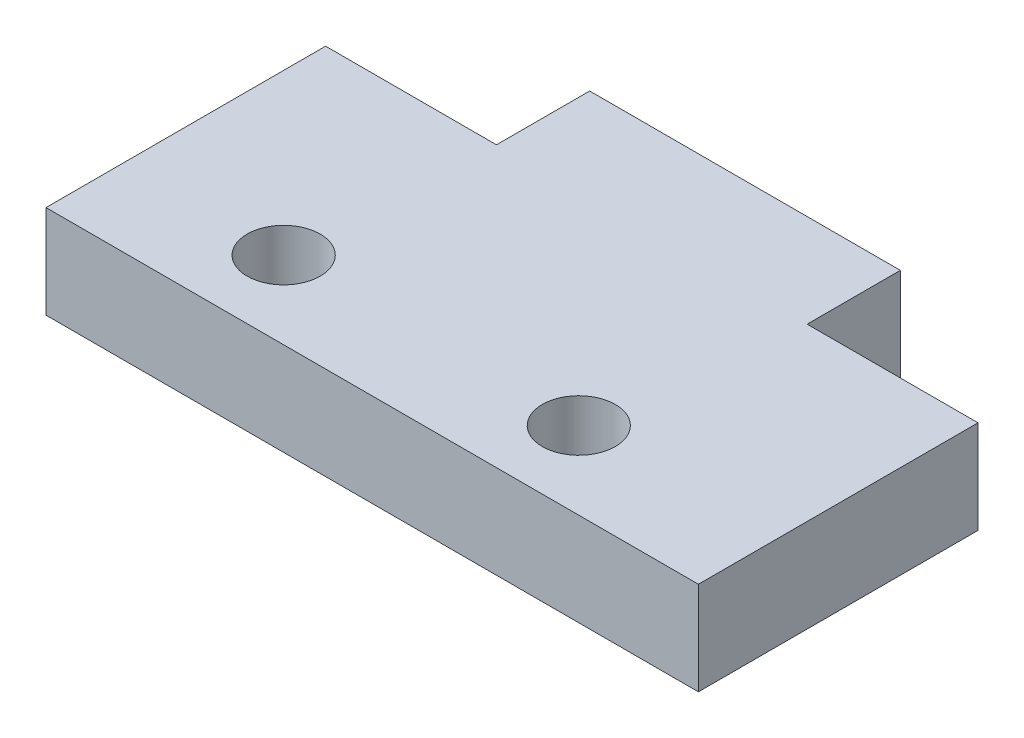
ISO-10303-21;
HEADER;
FILE_DESCRIPTION(('STEP AP214'),'2;1');
FILE_NAME('part.step','',(''),(''),'','','');
FILE_SCHEMA(('AUTOMOTIVE_DESIGN { 1 0 10303 214 1 1 1 1 }'));
ENDSEC;
DATA;
#1=APPLICATION_CONTEXT('core data for automotive mechanical design processes');
#2=APPLICATION_PROTOCOL_DEFINITION('international standard','automotive_design',2000,#1);
#3=PRODUCT_CONTEXT('',#1,'mechanical');
#4=PRODUCT('Part','Part','',(#3));
#5=PRODUCT_RELATED_PRODUCT_CATEGORY('part','',(#4));
#6=PRODUCT_DEFINITION_FORMATION('','',#4);
#7=PRODUCT_DEFINITION_CONTEXT('part definition',#1,'design');
#8=PRODUCT_DEFINITION('design','',#6,#7);
#9=PRODUCT_DEFINITION_SHAPE('','',#8);
#10=(LENGTH_UNIT() NAMED_UNIT(*) SI_UNIT(.MILLI.,.METRE.));
#11=(NAMED_UNIT(*) PLANE_ANGLE_UNIT() SI_UNIT($,.RADIAN.));
#12=(NAMED_UNIT(*) SI_UNIT($,.STERADIAN.) SOLID_ANGLE_UNIT());
#13=UNCERTAINTY_MEASURE_WITH_UNIT(LENGTH_MEASURE(1.E-05),#10,'distance_accuracy_value','');
#14=(GEOMETRIC_REPRESENTATION_CONTEXT(3) GLOBAL_UNCERTAINTY_ASSIGNED_CONTEXT((#13)) GLOBAL_UNIT_ASSIGNED_CONTEXT((#10,
#11,#12)) REPRESENTATION_CONTEXT('',''));
#15=CARTESIAN_POINT('',(0.,0.,0.));
#16=DIRECTION('',(0.,0.,1.));
#17=DIRECTION('',(1.,0.,0.));
#18=AXIS2_PLACEMENT_3D('',#15,#16,#17);
#19=CARTESIAN_POINT('',(0.,3.,0.));
#20=DIRECTION('',(0.,-1.,0.));
#21=DIRECTION('',(0.,0.,-1.));
#22=AXIS2_PLACEMENT_3D('',#19,#20,#21);
#23=PLANE('',#22);
#24=DIRECTION('',(0.,0.,1.));
#25=VECTOR('',#24,1.);
#26=CARTESIAN_POINT('',(0.,3.,3.));
#27=LINE('',#26,#25);
#28=CARTESIAN_POINT('',(0.,3.,0.));
#29=VERTEX_POINT('',#28);
#30=CARTESIAN_POINT('',(0.,3.,3.));
#31=VERTEX_POINT('',#30);
#32=EDGE_CURVE('E164',#29,#31,#27,.T.);
#33=ORIENTED_EDGE('',*,*,#32,.T.);
#34=DIRECTION('',(-1.,0.,0.));
#35=VECTOR('',#34,1.);
#36=CARTESIAN_POINT('',(-5.5,3.,3.));
#37=LINE('',#36,#35);
#38=CARTESIAN_POINT('',(-5.5,3.,3.));
#39=VERTEX_POINT('',#38);
#40=EDGE_CURVE('E100',#31,#39,#37,.T.);
#41=ORIENTED_EDGE('',*,*,#40,.T.);
#42=DIRECTION('',(0.,0.,1.));
#43=VECTOR('',#42,1.);
#44=CARTESIAN_POINT('',(-5.5,3.,12.));
#45=LINE('',#44,#43);
#46=CARTESIAN_POINT('',(-5.5,3.,12.));
#47=VERTEX_POINT('',#46);
#48=EDGE_CURVE('E185',#39,#47,#45,.T.);
#49=ORIENTED_EDGE('',*,*,#48,.T.);
#50=DIRECTION('',(1.,0.,0.));
#51=VECTOR('',#50,1.);
#52=CARTESIAN_POINT('',(15.5,3.,12.));
#53=LINE('',#52,#51);
#54=CARTESIAN_POINT('',(15.5,3.,12.));
#55=VERTEX_POINT('',#54);
#56=EDGE_CURVE('E199',#47,#55,#53,.T.);
#57=ORIENTED_EDGE('',*,*,#56,.T.);
#58=DIRECTION('',(0.,0.,-1.));
#59=VECTOR('',#58,1.);
#60=CARTESIAN_POINT('',(15.5,3.,3.));
#61=LINE('',#60,#59);
#62=CARTESIAN_POINT('',(15.5,3.,3.));
#63=VERTEX_POINT('',#62);
#64=EDGE_CURVE('E119',#55,#63,#61,.T.);
#65=ORIENTED_EDGE('',*,*,#64,.T.);
#66=DIRECTION('',(-1.,0.,0.));
#67=VECTOR('',#66,1.);
#68=CARTESIAN_POINT('',(10.,3.,3.));
#69=LINE('',#68,#67);
#70=CARTESIAN_POINT('',(10.,3.,3.));
#71=VERTEX_POINT('',#70);
#72=EDGE_CURVE('E113',#63,#71,#69,.T.);
#73=ORIENTED_EDGE('',*,*,#72,.T.);
#74=DIRECTION('',(0.,0.,-1.));
#75=VECTOR('',#74,1.);
#76=CARTESIAN_POINT('',(10.,3.,0.));
#77=LINE('',#76,#75);
#78=CARTESIAN_POINT('',(10.,3.,0.));
#79=VERTEX_POINT('',#78);
#80=EDGE_CURVE('E117',#71,#79,#77,.T.);
#81=ORIENTED_EDGE('',*,*,#80,.T.);
#82=DIRECTION('',(-1.,0.,0.));
#83=VECTOR('',#82,1.);
#84=CARTESIAN_POINT('',(0.,3.,0.));
#85=LINE('',#84,#83);
#86=EDGE_CURVE('E57',#79,#29,#85,.T.);
#87=ORIENTED_EDGE('',*,*,#86,.T.);
#88=EDGE_LOOP('',(#33,#41,#49,#57,#65,#73,#81,#87));
#89=FACE_BOUND('',#88,.T.);
#90=CARTESIAN_POINT('',(-0.35,3.,9.5));
#91=DIRECTION('',(0.,1.,0.));
#92=DIRECTION('',(0.,0.,1.));
#93=AXIS2_PLACEMENT_3D('',#90,#91,#92);
#94=CIRCLE('',#93,1.175);
#95=CARTESIAN_POINT('',(-0.35,3.,10.675));
#96=VERTEX_POINT('',#95);
#97=EDGE_CURVE('E146',#96,#96,#94,.T.);
#98=ORIENTED_EDGE('',*,*,#97,.F.);
#99=EDGE_LOOP('',(#98));
#100=FACE_BOUND('',#99,.T.);
#101=CARTESIAN_POINT('',(9.15,3.,9.5));
#102=DIRECTION('',(0.,1.,0.));
#103=DIRECTION('',(0.,0.,1.));
#104=AXIS2_PLACEMENT_3D('',#101,#102,#103);
#105=CIRCLE('',#104,1.175);
#106=CARTESIAN_POINT('',(9.15,3.,10.675));
#107=VERTEX_POINT('',#106);
#108=EDGE_CURVE('E213',#107,#107,#105,.T.);
#109=ORIENTED_EDGE('',*,*,#108,.F.);
#110=EDGE_LOOP('',(#109));
#111=FACE_BOUND('',#110,.T.);
#112=ADVANCED_FACE('F39',(#89,#100,#111),#23,.F.);
#113=CARTESIAN_POINT('',(0.,0.,0.));
#114=DIRECTION('',(0.,-1.,0.));
#115=DIRECTION('',(0.,0.,-1.));
#116=AXIS2_PLACEMENT_3D('',#113,#114,#115);
#117=PLANE('',#116);
#118=CARTESIAN_POINT('',(-0.35,0.,9.5));
#119=DIRECTION('',(0.,1.,0.));
#120=DIRECTION('',(0.,0.,1.));
#121=AXIS2_PLACEMENT_3D('',#118,#119,#120);
#122=CIRCLE('',#121,1.175);
#123=CARTESIAN_POINT('',(-0.35,0.,10.675));
#124=VERTEX_POINT('',#123);
#125=EDGE_CURVE('E209',#124,#124,#122,.T.);
#126=ORIENTED_EDGE('',*,*,#125,.T.);
#127=EDGE_LOOP('',(#126));
#128=FACE_BOUND('',#127,.T.);
#129=DIRECTION('',(0.,0.,1.));
#130=VECTOR('',#129,1.);
#131=CARTESIAN_POINT('',(0.,0.,3.));
#132=LINE('',#131,#130);
#133=CARTESIAN_POINT('',(0.,0.,0.));
#134=VERTEX_POINT('',#133);
#135=CARTESIAN_POINT('',(0.,0.,3.));
#136=VERTEX_POINT('',#135);
#137=EDGE_CURVE('E141',#134,#136,#132,.T.);
#138=ORIENTED_EDGE('',*,*,#137,.F.);
#139=DIRECTION('',(-1.,0.,0.));
#140=VECTOR('',#139,1.);
#141=CARTESIAN_POINT('',(0.,0.,0.));
#142=LINE('',#141,#140);
#143=CARTESIAN_POINT('',(10.,0.,0.));
#144=VERTEX_POINT('',#143);
#145=EDGE_CURVE('E92',#144,#134,#142,.T.);
#146=ORIENTED_EDGE('',*,*,#145,.F.);
#147=DIRECTION('',(0.,0.,-1.));
#148=VECTOR('',#147,1.);
#149=CARTESIAN_POINT('',(10.,0.,0.));
#150=LINE('',#149,#148);
#151=CARTESIAN_POINT('',(10.,0.,3.));
#152=VERTEX_POINT('',#151);
#153=EDGE_CURVE('E86',#152,#144,#150,.T.);
#154=ORIENTED_EDGE('',*,*,#153,.F.);
#155=DIRECTION('',(-1.,0.,0.));
#156=VECTOR('',#155,1.);
#157=CARTESIAN_POINT('',(10.,0.,3.));
#158=LINE('',#157,#156);
#159=CARTESIAN_POINT('',(15.5,0.,3.));
#160=VERTEX_POINT('',#159);
#161=EDGE_CURVE('E128',#160,#152,#158,.T.);
#162=ORIENTED_EDGE('',*,*,#161,.F.);
#163=DIRECTION('',(0.,0.,-1.));
#164=VECTOR('',#163,1.);
#165=CARTESIAN_POINT('',(15.5,0.,3.));
#166=LINE('',#165,#164);
#167=CARTESIAN_POINT('',(15.5,0.,12.));
#168=VERTEX_POINT('',#167);
#169=EDGE_CURVE('E155',#168,#160,#166,.T.);
#170=ORIENTED_EDGE('',*,*,#169,.F.);
#171=DIRECTION('',(1.,0.,0.));
#172=VECTOR('',#171,1.);
#173=CARTESIAN_POINT('',(15.5,0.,12.));
#174=LINE('',#173,#172);
#175=CARTESIAN_POINT('',(-5.5,0.,12.));
#176=VERTEX_POINT('',#175);
#177=EDGE_CURVE('E152',#176,#168,#174,.T.);
#178=ORIENTED_EDGE('',*,*,#177,.F.);
#179=DIRECTION('',(0.,0.,1.));
#180=VECTOR('',#179,1.);
#181=CARTESIAN_POINT('',(-5.5,0.,12.));
#182=LINE('',#181,#180);
#183=CARTESIAN_POINT('',(-5.5,0.,3.));
#184=VERTEX_POINT('',#183);
#185=EDGE_CURVE('E149',#184,#176,#182,.T.);
#186=ORIENTED_EDGE('',*,*,#185,.F.);
#187=DIRECTION('',(-1.,0.,0.));
#188=VECTOR('',#187,1.);
#189=CARTESIAN_POINT('',(-5.5,0.,3.));
#190=LINE('',#189,#188);
#191=EDGE_CURVE('E145',#136,#184,#190,.T.);
#192=ORIENTED_EDGE('',*,*,#191,.F.);
#193=EDGE_LOOP('',(#138,#146,#154,#162,#170,#178,#186,#192));
#194=FACE_BOUND('',#193,.T.);
#195=CARTESIAN_POINT('',(9.15,0.,9.5));
#196=DIRECTION('',(0.,1.,0.));
#197=DIRECTION('',(0.,0.,1.));
#198=AXIS2_PLACEMENT_3D('',#195,#196,#197);
#199=CIRCLE('',#198,1.175);
#200=CARTESIAN_POINT('',(9.15,0.,10.675));
#201=VERTEX_POINT('',#200);
#202=EDGE_CURVE('E217',#201,#201,#199,.T.);
#203=ORIENTED_EDGE('',*,*,#202,.T.);
#204=EDGE_LOOP('',(#203));
#205=FACE_BOUND('',#204,.T.);
#206=ADVANCED_FACE('F189',(#128,#194,#205),#117,.T.);
#207=CARTESIAN_POINT('',(0.,3.,3.));
#208=DIRECTION('',(1.,0.,0.));
#209=DIRECTION('',(0.,0.,-1.));
#210=AXIS2_PLACEMENT_3D('',#207,#208,#209);
#211=PLANE('',#210);
#212=ORIENTED_EDGE('',*,*,#137,.T.);
#213=DIRECTION('',(0.,-1.,0.));
#214=VECTOR('',#213,1.);
#215=CARTESIAN_POINT('',(0.,3.,3.));
#216=LINE('',#215,#214);
#217=EDGE_CURVE('E11',#31,#136,#216,.T.);
#218=ORIENTED_EDGE('',*,*,#217,.F.);
#219=ORIENTED_EDGE('',*,*,#32,.F.);
#220=DIRECTION('',(0.,-1.,0.));
#221=VECTOR('',#220,1.);
#222=CARTESIAN_POINT('',(0.,3.,0.));
#223=LINE('',#222,#221);
#224=EDGE_CURVE('E137',#29,#134,#223,.T.);
#225=ORIENTED_EDGE('',*,*,#224,.T.);
#226=EDGE_LOOP('',(#212,#218,#219,#225));
#227=FACE_BOUND('',#226,.T.);
#228=ADVANCED_FACE('F41',(#227),#211,.F.);
#229=CARTESIAN_POINT('',(-5.5,3.,3.));
#230=DIRECTION('',(0.,0.,1.));
#231=DIRECTION('',(1.,0.,0.));
#232=AXIS2_PLACEMENT_3D('',#229,#230,#231);
#233=PLANE('',#232);
#234=ORIENTED_EDGE('',*,*,#191,.T.);
#235=DIRECTION('',(0.,-1.,0.));
#236=VECTOR('',#235,1.);
#237=CARTESIAN_POINT('',(-5.5,3.,3.));
#238=LINE('',#237,#236);
#239=EDGE_CURVE('E49',#39,#184,#238,.T.);
#240=ORIENTED_EDGE('',*,*,#239,.F.);
#241=ORIENTED_EDGE('',*,*,#40,.F.);
#242=ORIENTED_EDGE('',*,*,#217,.T.);
#243=EDGE_LOOP('',(#234,#240,#241,#242));
#244=FACE_BOUND('',#243,.T.);
#245=ADVANCED_FACE('F251',(#244),#233,.F.);
#246=CARTESIAN_POINT('',(-5.5,3.,12.));
#247=DIRECTION('',(1.,0.,0.));
#248=DIRECTION('',(0.,0.,-1.));
#249=AXIS2_PLACEMENT_3D('',#246,#247,#248);
#250=PLANE('',#249);
#251=ORIENTED_EDGE('',*,*,#185,.T.);
#252=DIRECTION('',(0.,-1.,0.));
#253=VECTOR('',#252,1.);
#254=CARTESIAN_POINT('',(-5.5,3.,12.));
#255=LINE('',#254,#253);
#256=EDGE_CURVE('E175',#47,#176,#255,.T.);
#257=ORIENTED_EDGE('',*,*,#256,.F.);
#258=ORIENTED_EDGE('',*,*,#48,.F.);
#259=ORIENTED_EDGE('',*,*,#239,.T.);
#260=EDGE_LOOP('',(#251,#257,#258,#259));
#261=FACE_BOUND('',#260,.T.);
#262=ADVANCED_FACE('F183',(#261),#250,.F.);
#263=CARTESIAN_POINT('',(15.5,3.,12.));
#264=DIRECTION('',(0.,0.,-1.));
#265=DIRECTION('',(-1.,0.,0.));
#266=AXIS2_PLACEMENT_3D('',#263,#264,#265);
#267=PLANE('',#266);
#268=ORIENTED_EDGE('',*,*,#177,.T.);
#269=DIRECTION('',(0.,-1.,0.));
#270=VECTOR('',#269,1.);
#271=CARTESIAN_POINT('',(15.5,3.,12.));
#272=LINE('',#271,#270);
#273=EDGE_CURVE('E171',#55,#168,#272,.T.);
#274=ORIENTED_EDGE('',*,*,#273,.F.);
#275=ORIENTED_EDGE('',*,*,#56,.F.);
#276=ORIENTED_EDGE('',*,*,#256,.T.);
#277=EDGE_LOOP('',(#268,#274,#275,#276));
#278=FACE_BOUND('',#277,.T.);
#279=ADVANCED_FACE('F194',(#278),#267,.F.);
#280=CARTESIAN_POINT('',(15.5,3.,3.));
#281=DIRECTION('',(-1.,0.,0.));
#282=DIRECTION('',(0.,0.,1.));
#283=AXIS2_PLACEMENT_3D('',#280,#281,#282);
#284=PLANE('',#283);
#285=ORIENTED_EDGE('',*,*,#169,.T.);
#286=DIRECTION('',(0.,-1.,0.));
#287=VECTOR('',#286,1.);
#288=CARTESIAN_POINT('',(15.5,3.,3.));
#289=LINE('',#288,#287);
#290=EDGE_CURVE('E130',#63,#160,#289,.T.);
#291=ORIENTED_EDGE('',*,*,#290,.F.);
#292=ORIENTED_EDGE('',*,*,#64,.F.);
#293=ORIENTED_EDGE('',*,*,#273,.T.);
#294=EDGE_LOOP('',(#285,#291,#292,#293));
#295=FACE_BOUND('',#294,.T.);
#296=ADVANCED_FACE('F197',(#295),#284,.F.);
#297=CARTESIAN_POINT('',(10.,3.,3.));
#298=DIRECTION('',(0.,0.,1.));
#299=DIRECTION('',(1.,0.,0.));
#300=AXIS2_PLACEMENT_3D('',#297,#298,#299);
#301=PLANE('',#300);
#302=ORIENTED_EDGE('',*,*,#161,.T.);
#303=DIRECTION('',(0.,-1.,0.));
#304=VECTOR('',#303,1.);
#305=CARTESIAN_POINT('',(10.,3.,3.));
#306=LINE('',#305,#304);
#307=EDGE_CURVE('E125',#71,#152,#306,.T.);
#308=ORIENTED_EDGE('',*,*,#307,.F.);
#309=ORIENTED_EDGE('',*,*,#72,.F.);
#310=ORIENTED_EDGE('',*,*,#290,.T.);
#311=EDGE_LOOP('',(#302,#308,#309,#310));
#312=FACE_BOUND('',#311,.T.);
#313=ADVANCED_FACE('F126',(#312),#301,.F.);
#314=CARTESIAN_POINT('',(10.,3.,0.));
#315=DIRECTION('',(-1.,0.,0.));
#316=DIRECTION('',(0.,0.,1.));
#317=AXIS2_PLACEMENT_3D('',#314,#315,#316);
#318=PLANE('',#317);
#319=ORIENTED_EDGE('',*,*,#153,.T.);
#320=DIRECTION('',(0.,-1.,0.));
#321=VECTOR('',#320,1.);
#322=CARTESIAN_POINT('',(10.,3.,0.));
#323=LINE('',#322,#321);
#324=EDGE_CURVE('E131',#79,#144,#323,.T.);
#325=ORIENTED_EDGE('',*,*,#324,.F.);
#326=ORIENTED_EDGE('',*,*,#80,.F.);
#327=ORIENTED_EDGE('',*,*,#307,.T.);
#328=EDGE_LOOP('',(#319,#325,#326,#327));
#329=FACE_BOUND('',#328,.T.);
#330=ADVANCED_FACE('F133',(#329),#318,.F.);
#331=CARTESIAN_POINT('',(0.,3.,0.));
#332=DIRECTION('',(0.,0.,1.));
#333=DIRECTION('',(1.,0.,0.));
#334=AXIS2_PLACEMENT_3D('',#331,#332,#333);
#335=PLANE('',#334);
#336=ORIENTED_EDGE('',*,*,#145,.T.);
#337=ORIENTED_EDGE('',*,*,#224,.F.);
#338=ORIENTED_EDGE('',*,*,#86,.F.);
#339=ORIENTED_EDGE('',*,*,#324,.T.);
#340=EDGE_LOOP('',(#336,#337,#338,#339));
#341=FACE_BOUND('',#340,.T.);
#342=ADVANCED_FACE('F239',(#341),#335,.F.);
#343=CARTESIAN_POINT('',(-0.35,3.,9.5));
#344=DIRECTION('',(0.,-1.,0.));
#345=DIRECTION('',(0.,0.,-1.));
#346=AXIS2_PLACEMENT_3D('',#343,#344,#345);
#347=CYLINDRICAL_SURFACE('',#346,1.175);
#348=ORIENTED_EDGE('',*,*,#97,.T.);
#349=EDGE_LOOP('',(#348));
#350=FACE_BOUND('',#349,.T.);
#351=ORIENTED_EDGE('',*,*,#125,.F.);
#352=EDGE_LOOP('',(#351));
#353=FACE_BOUND('',#352,.T.);
#354=ADVANCED_FACE('F236',(#350,#353),#347,.F.);
#355=CARTESIAN_POINT('',(9.15,3.,9.5));
#356=DIRECTION('',(0.,-1.,0.));
#357=DIRECTION('',(0.,0.,-1.));
#358=AXIS2_PLACEMENT_3D('',#355,#356,#357);
#359=CYLINDRICAL_SURFACE('',#358,1.175);
#360=ORIENTED_EDGE('',*,*,#108,.T.);
#361=EDGE_LOOP('',(#360));
#362=FACE_BOUND('',#361,.T.);
#363=ORIENTED_EDGE('',*,*,#202,.F.);
#364=EDGE_LOOP('',(#363));
#365=FACE_BOUND('',#364,.T.);
#366=ADVANCED_FACE('F225',(#362,#365),#359,.F.);
#367=CLOSED_SHELL('',(#112,#206,#228,#245,#262,#279,#296,#313,#330,#342,#354,#366));
#368=MANIFOLD_SOLID_BREP('B2',#367);
#369=ADVANCED_BREP_SHAPE_REPRESENTATION('',(#18,#368),#14);
#370=SHAPE_DEFINITION_REPRESENTATION(#9,#369);
ENDSEC;
END-ISO-10303-21;
